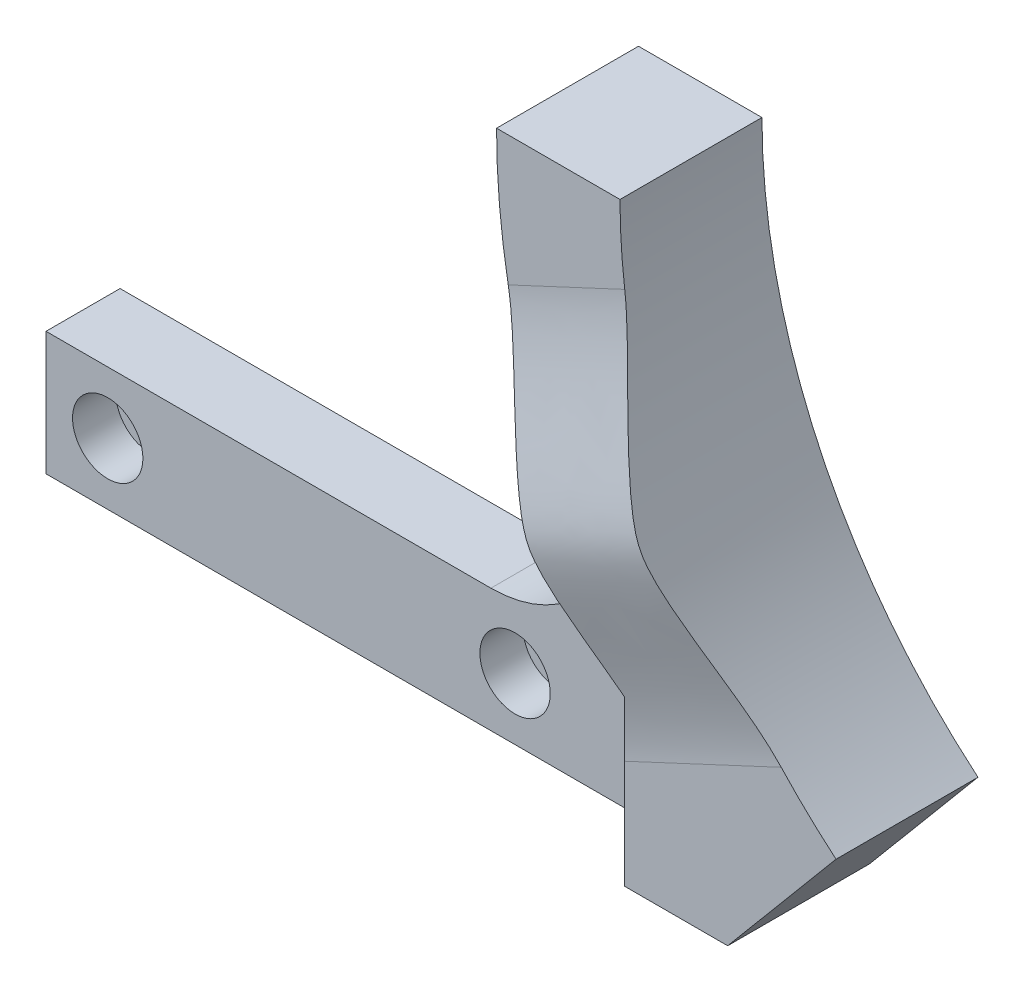
ISO-10303-21;
HEADER;
FILE_DESCRIPTION(('STEP AP214'),'2;1');
FILE_NAME('part.step','',(''),(''),'','','');
FILE_SCHEMA(('AUTOMOTIVE_DESIGN { 1 0 10303 214 1 1 1 1 }'));
ENDSEC;
DATA;
#1=APPLICATION_CONTEXT('core data for automotive mechanical design processes');
#2=APPLICATION_PROTOCOL_DEFINITION('international standard','automotive_design',2000,#1);
#3=PRODUCT_CONTEXT('',#1,'mechanical');
#4=PRODUCT('Part','Part','',(#3));
#5=PRODUCT_RELATED_PRODUCT_CATEGORY('part','',(#4));
#6=PRODUCT_DEFINITION_FORMATION('','',#4);
#7=PRODUCT_DEFINITION_CONTEXT('part definition',#1,'design');
#8=PRODUCT_DEFINITION('design','',#6,#7);
#9=PRODUCT_DEFINITION_SHAPE('','',#8);
#10=(LENGTH_UNIT() NAMED_UNIT(*) SI_UNIT(.MILLI.,.METRE.));
#11=(NAMED_UNIT(*) PLANE_ANGLE_UNIT() SI_UNIT($,.RADIAN.));
#12=(NAMED_UNIT(*) SI_UNIT($,.STERADIAN.) SOLID_ANGLE_UNIT());
#13=UNCERTAINTY_MEASURE_WITH_UNIT(LENGTH_MEASURE(1.E-05),#10,'distance_accuracy_value','');
#14=(GEOMETRIC_REPRESENTATION_CONTEXT(3) GLOBAL_UNCERTAINTY_ASSIGNED_CONTEXT((#13)) GLOBAL_UNIT_ASSIGNED_CONTEXT((#10,
#11,#12)) REPRESENTATION_CONTEXT('',''));
#15=CARTESIAN_POINT('',(0.,0.,0.));
#16=DIRECTION('',(0.,0.,1.));
#17=DIRECTION('',(1.,0.,0.));
#18=AXIS2_PLACEMENT_3D('',#15,#16,#17);
#19=CARTESIAN_POINT('',(0.,-48.,16.));
#20=DIRECTION('',(0.,-1.,0.));
#21=DIRECTION('',(0.,0.,-1.));
#22=AXIS2_PLACEMENT_3D('',#19,#20,#21);
#23=PLANE('',#22);
#24=DIRECTION('',(0.,0.,-1.));
#25=VECTOR('',#24,1.);
#26=CARTESIAN_POINT('',(-40.2767822965092,-48.,16.));
#27=LINE('',#26,#25);
#28=CARTESIAN_POINT('',(-40.2767822965092,-48.,11.5));
#29=VERTEX_POINT('',#28);
#30=CARTESIAN_POINT('',(-40.2767822965092,-48.,0.));
#31=VERTEX_POINT('',#30);
#32=EDGE_CURVE('E195',#29,#31,#27,.T.);
#33=ORIENTED_EDGE('',*,*,#32,.F.);
#34=DIRECTION('',(-1.,0.,0.));
#35=VECTOR('',#34,1.);
#36=CARTESIAN_POINT('',(0.,-48.,11.5));
#37=LINE('',#36,#35);
#38=CARTESIAN_POINT('',(-48.633136385587,-48.,11.5));
#39=VERTEX_POINT('',#38);
#40=EDGE_CURVE('E240',#29,#39,#37,.T.);
#41=ORIENTED_EDGE('',*,*,#40,.T.);
#42=DIRECTION('',(0.707106781186552,0.,0.707106781186543));
#43=VECTOR('',#42,1.);
#44=CARTESIAN_POINT('',(-54.1331363855871,-48.,6.));
#45=LINE('',#44,#43);
#46=CARTESIAN_POINT('',(-54.1331363855871,-48.,6.));
#47=VERTEX_POINT('',#46);
#48=EDGE_CURVE('E159',#39,#47,#45,.F.);
#49=ORIENTED_EDGE('',*,*,#48,.T.);
#50=DIRECTION('',(1.,0.,0.));
#51=VECTOR('',#50,1.);
#52=CARTESIAN_POINT('',(0.,-48.,6.));
#53=LINE('',#52,#51);
#54=CARTESIAN_POINT('',(-101.,-48.,6.));
#55=VERTEX_POINT('',#54);
#56=EDGE_CURVE('E238',#55,#47,#53,.T.);
#57=ORIENTED_EDGE('',*,*,#56,.F.);
#58=DIRECTION('',(0.,0.,-1.));
#59=VECTOR('',#58,1.);
#60=CARTESIAN_POINT('',(-101.,-48.,6.));
#61=LINE('',#60,#59);
#62=CARTESIAN_POINT('',(-101.,-48.,0.));
#63=VERTEX_POINT('',#62);
#64=EDGE_CURVE('E247',#55,#63,#61,.T.);
#65=ORIENTED_EDGE('',*,*,#64,.T.);
#66=DIRECTION('',(-1.,0.,0.));
#67=VECTOR('',#66,1.);
#68=CARTESIAN_POINT('',(0.,-48.,0.));
#69=LINE('',#68,#67);
#70=EDGE_CURVE('E290',#31,#63,#69,.T.);
#71=ORIENTED_EDGE('',*,*,#70,.F.);
#72=EDGE_LOOP('',(#33,#41,#49,#57,#65,#71));
#73=FACE_BOUND('',#72,.T.);
#74=ADVANCED_FACE('F51',(#73),#23,.T.);
#75=CARTESIAN_POINT('',(0.,0.,16.));
#76=DIRECTION('',(0.76604444311898,-0.642787609686537,0.));
#77=DIRECTION('',(0.642787609686537,0.76604444311898,0.));
#78=AXIS2_PLACEMENT_3D('',#75,#76,#77);
#79=PLANE('',#78);
#80=DIRECTION('',(0.,0.,-1.));
#81=VECTOR('',#80,1.);
#82=CARTESIAN_POINT('',(-31.4965928746403,-37.53617771283,16.));
#83=LINE('',#82,#81);
#84=CARTESIAN_POINT('',(-31.4965928746414,-37.5361777128291,11.5));
#85=VERTEX_POINT('',#84);
#86=CARTESIAN_POINT('',(-31.4965928746403,-37.53617771283,0.));
#87=VERTEX_POINT('',#86);
#88=EDGE_CURVE('E207',#85,#87,#83,.T.);
#89=ORIENTED_EDGE('',*,*,#88,.F.);
#90=DIRECTION('',(-0.642787609686537,-0.76604444311898,0.));
#91=VECTOR('',#90,1.);
#92=CARTESIAN_POINT('',(0.,0.,11.5));
#93=LINE('',#92,#91);
#94=EDGE_CURVE('E609',#85,#29,#93,.T.);
#95=ORIENTED_EDGE('',*,*,#94,.T.);
#96=ORIENTED_EDGE('',*,*,#32,.T.);
#97=DIRECTION('',(-0.642787609686537,-0.76604444311898,0.));
#98=VECTOR('',#97,1.);
#99=CARTESIAN_POINT('',(0.,0.,0.));
#100=LINE('',#99,#98);
#101=EDGE_CURVE('E293',#87,#31,#100,.T.);
#102=ORIENTED_EDGE('',*,*,#101,.F.);
#103=EDGE_LOOP('',(#89,#95,#96,#102));
#104=FACE_BOUND('',#103,.T.);
#105=ADVANCED_FACE('F313',(#104),#79,.T.);
#106=CARTESIAN_POINT('',(0.,0.,16.));
#107=DIRECTION('',(0.,0.,-1.));
#108=DIRECTION('',(-1.,0.,0.));
#109=AXIS2_PLACEMENT_3D('',#106,#107,#108);
#110=CYLINDRICAL_SURFACE('',#109,49.);
#111=CARTESIAN_POINT('',(-35.9378229389647,-33.308750838295,11.5));
#112=CARTESIAN_POINT('',(-36.0828055718518,-33.1523282330396,11.5000441153684));
#113=CARTESIAN_POINT('',(-36.226724633925,-32.9949977314904,11.5049518741036));
#114=CARTESIAN_POINT('',(-36.511779429045,-32.6792744581744,11.5232151562087));
#115=CARTESIAN_POINT('',(-36.6529229322838,-32.520887082193,11.536542038536));
#116=CARTESIAN_POINT('',(-36.932497551675,-32.2030334747427,11.5703502989782));
#117=CARTESIAN_POINT('',(-37.0709331634734,-32.0435697515184,11.5908185244696));
#118=CARTESIAN_POINT('',(-37.3451679828523,-31.7235368961756,11.6379219546674));
#119=CARTESIAN_POINT('',(-37.4809693154321,-31.5629688097481,11.664551943769));
#120=CARTESIAN_POINT('',(-37.7499869502496,-31.2407191341297,11.7231461916373));
#121=CARTESIAN_POINT('',(-37.8832038511465,-31.0790378148553,11.7551091981861));
#122=CARTESIAN_POINT('',(-38.1470936488032,-30.7545603504607,11.8236675394904));
#123=CARTESIAN_POINT('',(-38.277766260099,-30.5917640829841,11.8602633906251));
#124=CARTESIAN_POINT('',(-38.5392287458043,-30.2617427733269,11.9382622141065));
#125=CARTESIAN_POINT('',(-38.6699656215607,-30.0944955661962,11.9797486595496));
#126=CARTESIAN_POINT('',(-38.9288641930752,-29.7588386049857,12.0663414845673));
#127=CARTESIAN_POINT('',(-39.0570248108574,-29.590428402309,12.1114493415754));
#128=CARTESIAN_POINT('',(-39.310783613101,-29.2524692390308,12.2047667580792));
#129=CARTESIAN_POINT('',(-39.4363811011953,-29.0829199851667,12.2529771460943));
#130=CARTESIAN_POINT('',(-39.6850200442705,-28.742713437895,12.3520192910415));
#131=CARTESIAN_POINT('',(-39.8080614469559,-28.572056121911,12.4028511015317));
#132=CARTESIAN_POINT('',(-40.051590741875,-28.2296687839662,12.5066810377909));
#133=CARTESIAN_POINT('',(-40.1720794125876,-28.0579391103332,12.5596784882571));
#134=CARTESIAN_POINT('',(-40.4105035410321,-27.7134453493053,12.6673986159432));
#135=CARTESIAN_POINT('',(-40.5284407381459,-27.5406820761259,12.7221200511017));
#136=CARTESIAN_POINT('',(-40.775126317168,-27.1743117146055,12.8391934911535));
#137=CARTESIAN_POINT('',(-40.9035850893837,-26.9805614209489,12.9017074156669));
#138=CARTESIAN_POINT('',(-41.1575330220406,-26.591566540405,13.027819482014));
#139=CARTESIAN_POINT('',(-41.2830230803936,-26.3963224296048,13.0914172857425));
#140=CARTESIAN_POINT('',(-41.5312388683576,-26.0040403355113,13.219159821038));
#141=CARTESIAN_POINT('',(-41.6539624360739,-25.8070011074669,13.2833049297859));
#142=CARTESIAN_POINT('',(-41.8968404437741,-25.4108018355647,13.4115381568075));
#143=CARTESIAN_POINT('',(-42.016989862519,-25.2116386130278,13.4756259647461));
#144=CARTESIAN_POINT('',(-42.254911511439,-24.8108227345368,13.603023325155));
#145=CARTESIAN_POINT('',(-42.3726759905225,-24.6091646013167,13.6663301389729));
#146=CARTESIAN_POINT('',(-42.6021038522851,-24.2097542611364,13.7891426101433));
#147=CARTESIAN_POINT('',(-42.7138445438159,-24.0120640625562,13.8487053201927));
#148=CARTESIAN_POINT('',(-42.9349478190919,-23.6144450135583,13.9648400444535));
#149=CARTESIAN_POINT('',(-43.0443101380782,-23.414515917623,14.0214117266988));
#150=CARTESIAN_POINT('',(-43.2064929010695,-23.1130253839932,14.1027081525129));
#151=CARTESIAN_POINT('',(-43.2601735035993,-23.0123973497659,14.1291805758259));
#152=CARTESIAN_POINT('',(-43.366980123375,-22.8104818099786,14.1806876626119));
#153=CARTESIAN_POINT('',(-43.4201061509933,-22.7091943168101,14.2057223530143));
#154=CARTESIAN_POINT('',(-43.5255565338999,-22.5064195860316,14.253896568427));
#155=CARTESIAN_POINT('',(-43.5778835597155,-22.4049358363346,14.2770448848703));
#156=CARTESIAN_POINT('',(-43.6820205398699,-22.2012199779834,14.3211547080317));
#157=CARTESIAN_POINT('',(-43.7338304674844,-22.0989878311195,14.3421161022501));
#158=CARTESIAN_POINT('',(-43.8366427739065,-21.8943323064776,14.3811757920565));
#159=CARTESIAN_POINT('',(-43.8876480924343,-21.7919134690969,14.3992899735689));
#160=CARTESIAN_POINT('',(-43.9891633566667,-21.5862608762958,14.4320408578336));
#161=CARTESIAN_POINT('',(-44.0396732814748,-21.4830270868284,14.446677414495));
#162=CARTESIAN_POINT('',(-44.1448167584286,-21.2661931112256,14.4722946595423));
#163=CARTESIAN_POINT('',(-44.1994022391035,-21.1525128692056,14.4828152112044));
#164=CARTESIAN_POINT('',(-44.3078871815031,-20.9243182782984,14.4968027204552));
#165=CARTESIAN_POINT('',(-44.3617863577678,-20.8098036115977,14.5002668324885));
#166=CARTESIAN_POINT('',(-44.4686965692171,-20.5803558826527,14.4997003943759));
#167=CARTESIAN_POINT('',(-44.5217074386724,-20.4654227470991,14.4956684610782));
#168=CARTESIAN_POINT('',(-44.6266571623179,-20.2355488502493,14.4807176147875));
#169=CARTESIAN_POINT('',(-44.6785961307452,-20.1206080910892,14.4697994396462));
#170=CARTESIAN_POINT('',(-44.7816036678982,-19.8902985783187,14.4421619173692));
#171=CARTESIAN_POINT('',(-44.8326659810908,-19.7749308884846,14.4254114003187));
#172=CARTESIAN_POINT('',(-44.933645698972,-19.5443937160841,14.3875731056845));
#173=CARTESIAN_POINT('',(-44.9835628571685,-19.4292242810357,14.366484403874));
#174=CARTESIAN_POINT('',(-45.0823089059267,-19.1989874761285,14.3211408272418));
#175=CARTESIAN_POINT('',(-45.1311372965341,-19.0839201755436,14.2968845315641));
#176=CARTESIAN_POINT('',(-45.2277280521555,-18.8538637989774,14.2459635195538));
#177=CARTESIAN_POINT('',(-45.2754903258398,-18.7388747305096,14.2192985978643));
#178=CARTESIAN_POINT('',(-45.38746513735,-18.4663752155322,14.1539147618353));
#179=CARTESIAN_POINT('',(-45.4512255794578,-18.3088739486529,14.1143863135115));
#180=CARTESIAN_POINT('',(-45.5768598200282,-17.9938486560278,14.0328986732228));
#181=CARTESIAN_POINT('',(-45.6387345280201,-17.8363246792872,13.9909406823312));
#182=CARTESIAN_POINT('',(-45.76068731222,-17.521074649146,13.9052925380865));
#183=CARTESIAN_POINT('',(-45.8207655778234,-17.3633486188889,13.8616025684701));
#184=CARTESIAN_POINT('',(-45.9390569893807,-17.0479135283135,13.7731174231425));
#185=CARTESIAN_POINT('',(-45.9972737929884,-16.8902051302728,13.7283247657109));
#186=CARTESIAN_POINT('',(-46.1120184393976,-16.5743774078248,13.6379601999414));
#187=CARTESIAN_POINT('',(-46.1685460972137,-16.4162580404567,13.5923882071084));
#188=CARTESIAN_POINT('',(-46.2799359218681,-16.0995561484501,13.5008119416404));
#189=CARTESIAN_POINT('',(-46.3347980659433,-15.9409736175139,13.4548076631084));
#190=CARTESIAN_POINT('',(-46.4336231957289,-15.6504942585105,13.3705483273839));
#191=CARTESIAN_POINT('',(-46.4778436463898,-15.5186785268271,13.3323154626469));
#192=CARTESIAN_POINT('',(-46.5651635896562,-15.2546671553238,13.255898782844));
#193=CARTESIAN_POINT('',(-46.6082631155408,-15.1224715269124,13.2177149663541));
#194=CARTESIAN_POINT('',(-46.7359576124775,-14.7250721349627,13.1033813188175));
#195=CARTESIAN_POINT('',(-46.8188824380089,-14.4592500400537,13.0275060437007));
#196=CARTESIAN_POINT('',(-46.9803370311459,-13.92571828793,12.8774449519479));
#197=CARTESIAN_POINT('',(-47.0588656421176,-13.6580081546431,12.8032595829388));
#198=CARTESIAN_POINT('',(-47.2115058885154,-13.1206596889626,12.6575184334174));
#199=CARTESIAN_POINT('',(-47.2856181407824,-12.8510216317656,12.5859622862146));
#200=CARTESIAN_POINT('',(-47.4293970675374,-12.3097791127305,12.4464126880359));
#201=CARTESIAN_POINT('',(-47.4990657100952,-12.0381755815867,12.3784176622637));
#202=CARTESIAN_POINT('',(-47.6339259418596,-11.4929506001563,12.2469614948551));
#203=CARTESIAN_POINT('',(-47.6991202787174,-11.2193305046647,12.1834975697072));
#204=CARTESIAN_POINT('',(-47.8220139751161,-10.6830231164106,12.0650433178204));
#205=CARTESIAN_POINT('',(-47.8799229023432,-10.420441675006,12.0097924474002));
#206=CARTESIAN_POINT('',(-47.991625116054,-9.89325519587722,11.9054085549287));
#207=CARTESIAN_POINT('',(-48.045419410014,-9.62865067107559,11.8562740334162));
#208=CARTESIAN_POINT('',(-48.1488521105505,-9.0973239799196,11.7653687460721));
#209=CARTESIAN_POINT('',(-48.1984899424817,-8.83060152631671,11.7235989975664));
#210=CARTESIAN_POINT('',(-48.2935705299352,-8.29488433018129,11.6489431086666));
#211=CARTESIAN_POINT('',(-48.3390094001564,-8.02588772962679,11.6160651427162));
#212=CARTESIAN_POINT('',(-48.403960199066,-7.62072248164495,11.5749007150416));
#213=CARTESIAN_POINT('',(-48.4250995655423,-7.48522364803535,11.5625279542851));
#214=CARTESIAN_POINT('',(-48.4662735186563,-7.21381788053962,11.5408301318664));
#215=CARTESIAN_POINT('',(-48.4863081583991,-7.07791096660204,11.5315049235992));
#216=CARTESIAN_POINT('',(-48.5253533745721,-6.80508319944103,11.516201317669));
#217=CARTESIAN_POINT('',(-48.5443585152489,-6.6681606249287,11.5102393651308));
#218=CARTESIAN_POINT('',(-48.5812264995326,-6.39402661694983,11.5021439632996));
#219=CARTESIAN_POINT('',(-48.5990891455586,-6.2568151377359,11.5000111744983));
#220=CARTESIAN_POINT('',(-48.6163707911857,-6.11951722719552,11.5));
#221=B_SPLINE_CURVE_WITH_KNOTS('',3,(#111,#112,#113,#114,#115,#116,#117,#118,#119,#120,#121,
#122,#123,#124,#125,#126,#127,#128,#129,#130,#131,#132,#133,#134,#135,#136,#137,#138,#139,#140,
#141,#142,#143,#144,#145,#146,#147,#148,#149,#150,#151,#152,#153,#154,#155,#156,#157,#158,#159,
#160,#161,#162,#163,#164,#165,#166,#167,#168,#169,#170,#171,#172,#173,#174,#175,#176,#177,#178,
#179,#180,#181,#182,#183,#184,#185,#186,#187,#188,#189,#190,#191,#192,#193,#194,#195,#196,#197,
#198,#199,#200,#201,#202,#203,#204,#205,#206,#207,#208,#209,#210,#211,#212,#213,#214,#215,#216,
#217,#218,#219,#220),.UNSPECIFIED.,.F.,.F.,(4,2,2,2,2,2,2,2,2,2,2,2,2,2,2,2,2,2,2,2,2,2,2,2,2,2,
2,2,2,2,2,2,2,2,2,2,2,2,2,2,2,2,2,2,2,2,2,2,2,2,2,2,2,2,4),(0.,0.639696180130485,
1.27722780894541,1.91359140375036,2.54941830847455,3.18509612758451,3.82084486216108,
4.46968543790952,5.11879208068067,5.76807279009824,6.41736677019793,7.06645980593937,
7.71509543462776,8.43724471151841,9.15917270124803,9.88164655167936,10.6054206593946,
11.3312575683189,12.0355250984702,12.7398706300016,13.0911098709515,13.4423425308765,
13.7918315184542,14.1413384755959,14.4888202808314,14.836316680791,15.215777989146,
15.5953922874817,15.9750766382546,16.3547203132595,16.7364248836928,17.1182108585948,
17.5001686794885,17.8821590964889,18.4054867397553,18.9285578426642,19.4515736033739,
19.9734891343529,20.4954616145353,21.0174412254627,21.4500253578616,21.8825966325987,
22.7483775452001,23.6143851824745,24.480271578004,25.3457717715209,26.2107356193148,
27.0341696313839,27.8574013742057,28.6807467444019,29.5048464837918,29.9178995317241,
30.3309327064752,30.7459683400551,31.1610755561678),.UNSPECIFIED.);
#222=CARTESIAN_POINT('',(-35.9378229389647,-33.3087508382951,11.5));
#223=VERTEX_POINT('',#222);
#224=CARTESIAN_POINT('',(-48.6163707911857,-6.11951722719556,11.5));
#225=VERTEX_POINT('',#224);
#226=EDGE_CURVE('E320',#223,#225,#221,.T.);
#227=ORIENTED_EDGE('',*,*,#226,.F.);
#228=CARTESIAN_POINT('',(0.,0.,11.5));
#229=DIRECTION('',(0.,0.,1.));
#230=DIRECTION('',(0.,-1.,0.));
#231=AXIS2_PLACEMENT_3D('',#228,#229,#230);
#232=CIRCLE('',#231,49.);
#233=EDGE_CURVE('E165',#223,#85,#232,.T.);
#234=ORIENTED_EDGE('',*,*,#233,.T.);
#235=ORIENTED_EDGE('',*,*,#88,.T.);
#236=CARTESIAN_POINT('',(0.,0.,0.));
#237=DIRECTION('',(0.,0.,1.));
#238=DIRECTION('',(1.,0.,0.));
#239=AXIS2_PLACEMENT_3D('',#236,#237,#238);
#240=CIRCLE('',#239,49.);
#241=CARTESIAN_POINT('',(-49.,0.,0.));
#242=VERTEX_POINT('',#241);
#243=EDGE_CURVE('E297',#242,#87,#240,.T.);
#244=ORIENTED_EDGE('',*,*,#243,.F.);
#245=DIRECTION('',(0.,0.,-1.));
#246=VECTOR('',#245,1.);
#247=CARTESIAN_POINT('',(-49.,0.,16.));
#248=LINE('',#247,#246);
#249=CARTESIAN_POINT('',(-49.,0.,11.5));
#250=VERTEX_POINT('',#249);
#251=EDGE_CURVE('E301',#250,#242,#248,.T.);
#252=ORIENTED_EDGE('',*,*,#251,.F.);
#253=CARTESIAN_POINT('',(0.,0.,11.5));
#254=DIRECTION('',(0.,0.,-1.));
#255=DIRECTION('',(0.,1.,0.));
#256=AXIS2_PLACEMENT_3D('',#253,#254,#255);
#257=CIRCLE('',#256,49.);
#258=EDGE_CURVE('E173',#225,#250,#257,.T.);
#259=ORIENTED_EDGE('',*,*,#258,.F.);
#260=EDGE_LOOP('',(#227,#234,#235,#244,#252,#259));
#261=FACE_BOUND('',#260,.T.);
#262=ADVANCED_FACE('F309',(#261),#110,.F.);
#263=CARTESIAN_POINT('',(-54.1331363855871,0.,6.));
#264=DIRECTION('',(-0.707106781186543,0.,0.707106781186552));
#265=DIRECTION('',(0.,-1.,0.));
#266=AXIS2_PLACEMENT_3D('',#263,#264,#265);
#267=PLANE('',#266);
#268=DIRECTION('',(0.,1.,0.));
#269=VECTOR('',#268,1.);
#270=CARTESIAN_POINT('',(-48.6331363855871,0.,11.5));
#271=LINE('',#270,#269);
#272=CARTESIAN_POINT('',(-48.633136385587,-39.228672721133,11.5));
#273=VERTEX_POINT('',#272);
#274=EDGE_CURVE('E158',#273,#39,#271,.F.);
#275=ORIENTED_EDGE('',*,*,#274,.F.);
#276=CARTESIAN_POINT('',(-48.633136385587,-39.228672721133,11.5));
#277=CARTESIAN_POINT('',(-48.6331258540808,-39.1022612927181,11.5000105315062));
#278=CARTESIAN_POINT('',(-48.6315595329767,-38.9758669130698,11.5015768526103));
#279=CARTESIAN_POINT('',(-48.6256531915161,-38.7232350293088,11.507483194071));
#280=CARTESIAN_POINT('',(-48.6213138211392,-38.5969974953783,11.5118225644478));
#281=CARTESIAN_POINT('',(-48.6102262823021,-38.3453632950724,11.522910103285));
#282=CARTESIAN_POINT('',(-48.6034900700235,-38.2199655473611,11.5296463155636));
#283=CARTESIAN_POINT('',(-48.5878720535509,-37.9694327559949,11.5452643320361));
#284=CARTESIAN_POINT('',(-48.5789901078312,-37.8442977302177,11.5541462777559));
#285=CARTESIAN_POINT('',(-48.5495281904233,-37.4699006744465,11.5836081951638));
#286=CARTESIAN_POINT('',(-48.526105064828,-37.2210824517704,11.607031320759));
#287=CARTESIAN_POINT('',(-48.4731776620089,-36.7249521162199,11.6599587235781));
#288=CARTESIAN_POINT('',(-48.4436776105079,-36.4776390790613,11.6894587750792));
#289=CARTESIAN_POINT('',(-48.3796991680428,-35.9843092222954,11.7534372175442));
#290=CARTESIAN_POINT('',(-48.3452206797331,-35.7382924281315,11.7879157058539));
#291=CARTESIAN_POINT('',(-48.2722587981285,-35.2481623843473,11.8608775874585));
#292=CARTESIAN_POINT('',(-48.2337866258064,-35.0040457675113,11.8993497597806));
#293=CARTESIAN_POINT('',(-48.1534209546344,-34.516760064044,11.9797154309526));
#294=CARTESIAN_POINT('',(-48.1115249895043,-34.2735917950227,12.0216113960828));
#295=CARTESIAN_POINT('',(-48.0248763238047,-33.7881205044935,12.1082600617823));
#296=CARTESIAN_POINT('',(-47.9801218820686,-33.5458181071353,12.1530145035184));
#297=CARTESIAN_POINT('',(-47.8882398475198,-33.0620265929839,12.2448965380673));
#298=CARTESIAN_POINT('',(-47.8411114264962,-32.8205377918183,12.2920249590908));
#299=CARTESIAN_POINT('',(-47.7449072862661,-32.3383435659579,12.3882290993209));
#300=CARTESIAN_POINT('',(-47.6958315975466,-32.0976381290622,12.4373047880405));
#301=CARTESIAN_POINT('',(-47.5868485121133,-31.5723096228772,12.5462878734737));
#302=CARTESIAN_POINT('',(-47.5266201244363,-31.287820007937,12.6065162611507));
#303=CARTESIAN_POINT('',(-47.404510061267,-30.7196731591138,12.72862632432));
#304=CARTESIAN_POINT('',(-47.3426290290903,-30.4360156477007,12.7905073564967));
#305=CARTESIAN_POINT('',(-47.2177214342987,-29.8692858769972,12.9154149512883));
#306=CARTESIAN_POINT('',(-47.1546951662706,-29.586213487492,12.9784412193164));
#307=CARTESIAN_POINT('',(-47.0280018052122,-29.0204089556606,13.1051345803748));
#308=CARTESIAN_POINT('',(-46.9643348217915,-28.7376767640987,13.1688015637955));
#309=CARTESIAN_POINT('',(-46.836891313273,-28.1722958082986,13.296245072314));
#310=CARTESIAN_POINT('',(-46.7731148008185,-27.8896470383353,13.3600215847685));
#311=CARTESIAN_POINT('',(-46.6458517850984,-27.3232798685408,13.4872846004886));
#312=CARTESIAN_POINT('',(-46.5823667352657,-27.0395608124695,13.5507696503213));
#313=CARTESIAN_POINT('',(-46.4566042973438,-26.4715739489722,13.6765320882433));
#314=CARTESIAN_POINT('',(-46.3943269569717,-26.1873061203498,13.7388094286154));
#315=CARTESIAN_POINT('',(-46.2719001976092,-25.6177963527031,13.8612361879778));
#316=CARTESIAN_POINT('',(-46.2117511252765,-25.33255426321,13.9213852603105));
#317=CARTESIAN_POINT('',(-46.1241148830345,-24.9035560732202,14.0090215025525));
#318=CARTESIAN_POINT('',(-46.0953272962711,-24.7603322818923,14.0378090893159));
#319=CARTESIAN_POINT('',(-46.0388550913202,-24.4734542943899,14.0942812942668));
#320=CARTESIAN_POINT('',(-46.0111704385906,-24.3298001118462,14.1219659469964));
#321=CARTESIAN_POINT('',(-45.9571469095821,-24.0417936704042,14.1759894760049));
#322=CARTESIAN_POINT('',(-45.9308097301422,-23.8974407702916,14.2023266554448));
#323=CARTESIAN_POINT('',(-45.8799214769649,-23.6080916026447,14.2532149086221));
#324=CARTESIAN_POINT('',(-45.8553705996853,-23.4630952662,14.2777657859017));
#325=CARTESIAN_POINT('',(-45.8319177017664,-23.3177325522374,14.3012186838205));
#326=B_SPLINE_CURVE_WITH_KNOTS('',3,(#276,#277,#278,#279,#280,#281,#282,#283,#284,#285,#286,
#287,#288,#289,#290,#291,#292,#293,#294,#295,#296,#297,#298,#299,#300,#301,#302,#303,#304,#305,
#306,#307,#308,#309,#310,#311,#312,#313,#314,#315,#316,#317,#318,#319,#320,#321,#322,#323,#324,
#325),.UNSPECIFIED.,.F.,.F.,(4,2,2,2,2,2,2,2,2,2,2,2,2,2,2,2,2,2,2,2,2,2,2,2,4),(0.,
0.379190680271229,0.758292513976875,1.13552918914733,1.51279075245233,2.26561890430465,
3.01792531721352,3.77024644232308,4.52050823782985,5.27131531974447,6.02258418028459,
6.77411697635047,7.52563801086035,8.4165238080879,9.3070677294965,10.1973857328483,
11.0875539312317,11.9776254854224,12.870379698003,13.7631691121859,14.6561032829396,
15.1027892340775,15.5494611847676,15.9966824313855,16.4439527893475),.UNSPECIFIED.);
#327=CARTESIAN_POINT('',(-48.0938738821042,-34.1757120629879,12.0392625034829));
#328=VERTEX_POINT('',#327);
#329=EDGE_CURVE('E146',#273,#328,#326,.T.);
#330=ORIENTED_EDGE('',*,*,#329,.T.);
#331=CARTESIAN_POINT('',(0.,0.,60.1331363855865));
#332=DIRECTION('',(-0.707106781186543,0.,0.707106781186552));
#333=DIRECTION('',(-0.707106781186552,0.,-0.707106781186543));
#334=AXIS2_PLACEMENT_3D('',#331,#332,#333);
#335=ELLIPSE('',#334,83.4386001800121,59.);
#336=CARTESIAN_POINT('',(-54.1331363855871,-23.4649428948682,6.));
#337=VERTEX_POINT('',#336);
#338=EDGE_CURVE('E231',#337,#328,#335,.T.);
#339=ORIENTED_EDGE('',*,*,#338,.F.);
#340=DIRECTION('',(0.,1.,0.));
#341=VECTOR('',#340,1.);
#342=CARTESIAN_POINT('',(-54.1331363855871,-38.,6.));
#343=LINE('',#342,#341);
#344=EDGE_CURVE('E227',#47,#337,#343,.T.);
#345=ORIENTED_EDGE('',*,*,#344,.F.);
#346=ORIENTED_EDGE('',*,*,#48,.F.);
#347=EDGE_LOOP('',(#275,#330,#339,#345,#346));
#348=FACE_BOUND('',#347,.T.);
#349=ADVANCED_FACE('F170',(#348),#267,.T.);
#350=CARTESIAN_POINT('',(0.,0.,16.));
#351=DIRECTION('',(0.,-1.,0.));
#352=DIRECTION('',(0.,0.,-1.));
#353=AXIS2_PLACEMENT_3D('',#350,#351,#352);
#354=PLANE('',#353);
#355=DIRECTION('',(0.,0.,-1.));
#356=VECTOR('',#355,1.);
#357=CARTESIAN_POINT('',(-59.,0.,16.));
#358=LINE('',#357,#356);
#359=CARTESIAN_POINT('',(-59.,0.,11.5));
#360=VERTEX_POINT('',#359);
#361=CARTESIAN_POINT('',(-59.,0.,0.));
#362=VERTEX_POINT('',#361);
#363=EDGE_CURVE('E193',#360,#362,#358,.T.);
#364=ORIENTED_EDGE('',*,*,#363,.F.);
#365=DIRECTION('',(1.,0.,0.));
#366=VECTOR('',#365,1.);
#367=CARTESIAN_POINT('',(0.,0.,11.5));
#368=LINE('',#367,#366);
#369=EDGE_CURVE('E318',#360,#250,#368,.T.);
#370=ORIENTED_EDGE('',*,*,#369,.T.);
#371=ORIENTED_EDGE('',*,*,#251,.T.);
#372=DIRECTION('',(-1.,0.,0.));
#373=VECTOR('',#372,1.);
#374=CARTESIAN_POINT('',(0.,0.,0.));
#375=LINE('',#374,#373);
#376=EDGE_CURVE('E283',#242,#362,#375,.T.);
#377=ORIENTED_EDGE('',*,*,#376,.T.);
#378=EDGE_LOOP('',(#364,#370,#371,#377));
#379=FACE_BOUND('',#378,.T.);
#380=ADVANCED_FACE('F316',(#379),#354,.F.);
#381=CARTESIAN_POINT('',(0.,0.,16.));
#382=DIRECTION('',(0.,0.,-1.));
#383=DIRECTION('',(-1.,0.,0.));
#384=AXIS2_PLACEMENT_3D('',#381,#382,#383);
#385=CYLINDRICAL_SURFACE('',#384,59.);
#386=CARTESIAN_POINT('',(-45.375890470512,-37.7097940064395,11.5));
#387=CARTESIAN_POINT('',(-45.446253965841,-37.6251263924657,11.500003165524));
#388=CARTESIAN_POINT('',(-45.5163752732543,-37.5402676682313,11.5013616810718));
#389=CARTESIAN_POINT('',(-45.6560982826217,-37.3702126780047,11.5065809270849));
#390=CARTESIAN_POINT('',(-45.7257000335375,-37.2850164450069,11.5104414186809));
#391=CARTESIAN_POINT('',(-45.9331368070137,-37.0296491379864,11.5254234231554));
#392=CARTESIAN_POINT('',(-46.0701684156819,-36.859019452136,11.5399489083629));
#393=CARTESIAN_POINT('',(-46.3416125249617,-36.5171534077401,11.5766814481426));
#394=CARTESIAN_POINT('',(-46.4760301214839,-36.3459192077742,11.5988715440765));
#395=CARTESIAN_POINT('',(-46.7423504632007,-36.0027747764466,11.6497885440048));
#396=CARTESIAN_POINT('',(-46.8742557250706,-35.8308654549924,11.6785084882492));
#397=CARTESIAN_POINT('',(-47.1356260428236,-35.4863283343777,11.741548241151));
#398=CARTESIAN_POINT('',(-47.2650919443004,-35.3137008104893,11.7758660679509));
#399=CARTESIAN_POINT('',(-47.5216455396354,-34.9676935777252,11.849317329101));
#400=CARTESIAN_POINT('',(-47.648733079263,-34.7943138209611,11.8884510745129));
#401=CARTESIAN_POINT('',(-47.9025265106982,-34.4440917225211,11.9714978791894));
#402=CARTESIAN_POINT('',(-48.0291949142785,-34.2672378321092,12.0154764658856));
#403=CARTESIAN_POINT('',(-48.2801932858342,-33.912684025668,12.1070933716755));
#404=CARTESIAN_POINT('',(-48.4045220389103,-33.7349837270418,12.1547335301893));
#405=CARTESIAN_POINT('',(-48.6508714689516,-33.378730155017,12.2531179677648));
#406=CARTESIAN_POINT('',(-48.7728911449345,-33.2001765519015,12.3038635544176));
#407=CARTESIAN_POINT('',(-49.0146451148511,-32.8422170467852,12.407945659889));
#408=CARTESIAN_POINT('',(-49.1343788659158,-32.6628109546614,12.4612827837504));
#409=CARTESIAN_POINT('',(-49.3715786771103,-32.3031518915213,12.5700620020297));
#410=CARTESIAN_POINT('',(-49.4890448204982,-32.1228989519015,12.6255040189412));
#411=CARTESIAN_POINT('',(-49.7217242216087,-31.7615538208964,12.7380207410463));
#412=CARTESIAN_POINT('',(-49.8369383007697,-31.5804619664864,12.795094831501));
#413=CARTESIAN_POINT('',(-50.0640962829114,-31.2190865471301,12.9098829634234));
#414=CARTESIAN_POINT('',(-50.1760611586927,-31.0388124266023,12.9675852689224));
#415=CARTESIAN_POINT('',(-50.3979029466342,-30.6772936085655,13.0837086374096));
#416=CARTESIAN_POINT('',(-50.5077804666378,-30.4960492139375,13.1421294827329));
#417=CARTESIAN_POINT('',(-50.725562747215,-30.1324112790402,13.2592459415164));
#418=CARTESIAN_POINT('',(-50.8334670842141,-29.9500175030795,13.3179416106526));
#419=CARTESIAN_POINT('',(-51.0474167197661,-29.5838847320641,13.4351121663681));
#420=CARTESIAN_POINT('',(-51.1534606411264,-29.400144872294,13.4935868661677));
#421=CARTESIAN_POINT('',(-51.363805703961,-29.0310976371745,13.6097352654666));
#422=CARTESIAN_POINT('',(-51.4681045578751,-28.8457886209597,13.6674078990462));
#423=CARTESIAN_POINT('',(-51.6723171655837,-28.4783200501797,13.7797144093027));
#424=CARTESIAN_POINT('',(-51.7722753768028,-28.2961974538506,13.834388206352));
#425=CARTESIAN_POINT('',(-51.9705628695924,-27.9303399869584,13.94132396939));
#426=CARTESIAN_POINT('',(-52.0688920289607,-27.7466049970104,13.993585754964));
#427=CARTESIAN_POINT('',(-52.2639020499497,-27.3775102315005,14.0944590971005));
#428=CARTESIAN_POINT('',(-52.3605844600634,-27.1921522624344,14.1430742480261));
#429=CARTESIAN_POINT('',(-52.5523371010432,-26.8196880102424,14.2349774167993));
#430=CARTESIAN_POINT('',(-52.6474098315186,-26.6325853062703,14.2782745046827));
#431=CARTESIAN_POINT('',(-52.78892953319,-26.3503314858304,14.3372997663879));
#432=CARTESIAN_POINT('',(-52.8358856487063,-26.2560530802761,14.3559760796992));
#433=CARTESIAN_POINT('',(-52.929471377059,-26.0668793032655,14.3908948473802));
#434=CARTESIAN_POINT('',(-52.9761009892759,-25.9719839306392,14.4071372971335));
#435=CARTESIAN_POINT('',(-53.0626784786307,-25.7945830714943,14.4345213807278));
#436=CARTESIAN_POINT('',(-53.1026674833841,-25.7121592045241,14.4460568730313));
#437=CARTESIAN_POINT('',(-53.1824022259629,-25.5468298303706,14.4661512270244));
#438=CARTESIAN_POINT('',(-53.2221479770211,-25.4639243498733,14.4747102520694));
#439=CARTESIAN_POINT('',(-53.3013207736592,-25.2977797717943,14.4882813728343));
#440=CARTESIAN_POINT('',(-53.3407481255427,-25.2145411500775,14.4932974182607));
#441=CARTESIAN_POINT('',(-53.4192679947449,-25.0477604088041,14.4994424728398));
#442=CARTESIAN_POINT('',(-53.4583605142317,-24.9642182912179,14.5005715071822));
#443=CARTESIAN_POINT('',(-53.5361333487736,-24.7969943447233,14.4988843742443));
#444=CARTESIAN_POINT('',(-53.5748137070527,-24.7133125315511,14.4960686248449));
#445=CARTESIAN_POINT('',(-53.6517038713417,-24.5459396756275,14.4867143328038));
#446=CARTESIAN_POINT('',(-53.6899136489117,-24.4622486326238,14.480175566275));
#447=CARTESIAN_POINT('',(-53.7658390077028,-24.2949172099863,14.4637870883197));
#448=CARTESIAN_POINT('',(-53.8035543090271,-24.2112768826136,14.4539355792389));
#449=CARTESIAN_POINT('',(-53.8784517391261,-24.0441432631645,14.4314024470009));
#450=CARTESIAN_POINT('',(-53.9156338590325,-23.960649973554,14.4187207768281));
#451=CARTESIAN_POINT('',(-53.9901762544671,-23.7922153520059,14.3908362360896));
#452=CARTESIAN_POINT('',(-54.0275263691623,-23.7072768205203,14.3755898383141));
#453=CARTESIAN_POINT('',(-54.1016953484321,-23.5375261820057,14.3432363466771));
#454=CARTESIAN_POINT('',(-54.1385142149963,-23.4527140745043,14.3261292597863));
#455=CARTESIAN_POINT('',(-54.2482862497531,-23.1982243115859,14.2725222395351));
#456=CARTESIAN_POINT('',(-54.3204682669457,-23.0286889108583,14.2337707789065));
#457=CARTESIAN_POINT('',(-54.4629867416156,-22.6895778591164,14.1521850358859));
#458=CARTESIAN_POINT('',(-54.533320728857,-22.5200024323465,14.1093456112712));
#459=CARTESIAN_POINT('',(-54.6722014886582,-22.180712519589,14.0208268616309));
#460=CARTESIAN_POINT('',(-54.7407469241625,-22.0109980221637,13.9751454937912));
#461=CARTESIAN_POINT('',(-54.8830566647982,-21.6538853818423,13.8770385204054));
#462=CARTESIAN_POINT('',(-54.9566299281827,-21.4664690171805,13.8244033079805));
#463=CARTESIAN_POINT('',(-55.1017150001197,-21.0912648468652,13.7176312581003));
#464=CARTESIAN_POINT('',(-55.1732267674731,-20.9034770338684,13.6634943906768));
#465=CARTESIAN_POINT('',(-55.3846674505626,-20.3396108964484,13.4999115118969));
#466=CARTESIAN_POINT('',(-55.5216053639931,-19.9627697797024,13.3892196709699));
#467=CARTESIAN_POINT('',(-55.7877030816727,-19.2065786134411,13.1684737116736));
#468=CARTESIAN_POINT('',(-55.9168697592206,-18.8272311204041,13.0584191099509));
#469=CARTESIAN_POINT('',(-56.1675906793719,-18.0655016110664,12.8419027243164));
#470=CARTESIAN_POINT('',(-56.2891532109116,-17.6831234295704,12.7354370887614));
#471=CARTESIAN_POINT('',(-56.5247619517083,-16.914861279107,12.5288026808229));
#472=CARTESIAN_POINT('',(-56.6388165411731,-16.5289817852906,12.4286268938161));
#473=CARTESIAN_POINT('',(-56.8524806284295,-15.7777688707875,12.2434142334266));
#474=CARTESIAN_POINT('',(-56.952547423543,-15.4127046641775,12.1578185025191));
#475=CARTESIAN_POINT('',(-57.1461855295717,-14.6784757463263,11.9972121120364));
#476=CARTESIAN_POINT('',(-57.2397560529666,-14.3093105442064,11.9222027346734));
#477=CARTESIAN_POINT('',(-57.4204099409394,-13.5662402917052,11.7860452649329));
#478=CARTESIAN_POINT('',(-57.5074844175004,-13.1923295376622,11.7249159381478));
#479=CARTESIAN_POINT('',(-57.6331391898949,-12.6276933973035,11.6470527087326));
#480=CARTESIAN_POINT('',(-57.6742718438333,-12.4384875395359,11.6233714642959));
#481=CARTESIAN_POINT('',(-57.754785653288,-12.0591181664725,11.5814503247316));
#482=CARTESIAN_POINT('',(-57.7941670170855,-11.8689547680681,11.5632097810601));
#483=CARTESIAN_POINT('',(-57.8714628536666,-11.4861746233592,11.532911452549));
#484=CARTESIAN_POINT('',(-57.9093624982339,-11.2935505948775,11.5209060577356));
#485=CARTESIAN_POINT('',(-57.9833087758336,-10.9075472385878,11.5044722069548));
#486=CARTESIAN_POINT('',(-58.0193546128361,-10.7141676240513,11.5000469800127));
#487=CARTESIAN_POINT('',(-58.054438322733,-10.5205603953399,11.5));
#488=B_SPLINE_CURVE_WITH_KNOTS('',3,(#386,#387,#388,#389,#390,#391,#392,#393,#394,#395,#396,
#397,#398,#399,#400,#401,#402,#403,#404,#405,#406,#407,#408,#409,#410,#411,#412,#413,#414,#415,
#416,#417,#418,#419,#420,#421,#422,#423,#424,#425,#426,#427,#428,#429,#430,#431,#432,#433,#434,
#435,#436,#437,#438,#439,#440,#441,#442,#443,#444,#445,#446,#447,#448,#449,#450,#451,#452,#453,
#454,#455,#456,#457,#458,#459,#460,#461,#462,#463,#464,#465,#466,#467,#468,#469,#470,#471,#472,
#473,#474,#475,#476,#477,#478,#479,#480,#481,#482,#483,#484,#485,#486,#487),.UNSPECIFIED.,.F.,
.F.,(4,2,2,2,2,2,2,2,2,2,2,2,2,2,2,2,2,2,2,2,2,2,2,2,2,2,2,2,2,2,2,2,2,2,2,2,2,2,2,2,2,2,2,2,2,
2,2,2,2,2,4),(0.,0.33024606646971,0.660460608238893,1.31823966487577,1.97457255174308,
2.63020914750054,3.28561412545147,3.94106145846269,4.60682485310833,5.27292491328378,
5.93930740171977,6.60584622427064,7.27236052726193,7.93862700377502,8.59837049137543,
9.25791882019852,9.91760710760956,10.5777647180206,11.2387288858174,11.8831822890477,
12.5276838185118,13.1715415015404,13.8142853612086,14.1351660730424,14.4560473934903,
14.7330165238961,15.0099704512022,15.2866151414411,15.5632580388827,15.8398716330589,
16.1165018633988,16.3932824495802,16.6700676340796,16.952139236535,17.2342097823098,
17.7990006349275,18.3645115420404,18.9304337482798,19.5547340031853,20.1790467261453,
21.4268039414483,22.6734408390569,23.9186942624231,25.1625333287311,26.3266117087821,
27.4908309604556,28.6566149669507,29.2417493510115,29.8268139578158,30.4167180492241,
31.006873367514),.UNSPECIFIED.);
#489=CARTESIAN_POINT('',(-58.0544383227329,-10.5205603953399,11.5));
#490=VERTEX_POINT('',#489);
#491=EDGE_CURVE('E153',#328,#490,#488,.T.);
#492=ORIENTED_EDGE('',*,*,#491,.T.);
#493=CARTESIAN_POINT('',(0.,0.,11.5));
#494=DIRECTION('',(0.,0.,-1.));
#495=DIRECTION('',(0.,1.,0.));
#496=AXIS2_PLACEMENT_3D('',#493,#494,#495);
#497=CIRCLE('',#496,59.);
#498=EDGE_CURVE('E324',#490,#360,#497,.T.);
#499=ORIENTED_EDGE('',*,*,#498,.T.);
#500=ORIENTED_EDGE('',*,*,#363,.T.);
#501=CARTESIAN_POINT('',(0.,0.,0.));
#502=DIRECTION('',(0.,0.,1.));
#503=DIRECTION('',(1.,0.,0.));
#504=AXIS2_PLACEMENT_3D('',#501,#502,#503);
#505=CIRCLE('',#504,59.);
#506=CARTESIAN_POINT('',(-54.4646187876371,-22.68491349592,0.));
#507=VERTEX_POINT('',#506);
#508=EDGE_CURVE('E287',#362,#507,#505,.T.);
#509=ORIENTED_EDGE('',*,*,#508,.T.);
#510=DIRECTION('',(0.,0.,-1.));
#511=VECTOR('',#510,1.);
#512=CARTESIAN_POINT('',(-54.4646187876371,-22.68491349592,16.));
#513=LINE('',#512,#511);
#514=CARTESIAN_POINT('',(-54.4646187876371,-22.68491349592,6.));
#515=VERTEX_POINT('',#514);
#516=EDGE_CURVE('E217',#507,#515,#513,.F.);
#517=ORIENTED_EDGE('',*,*,#516,.T.);
#518=CARTESIAN_POINT('',(0.,0.,6.));
#519=DIRECTION('',(0.,0.,1.));
#520=DIRECTION('',(1.,0.,0.));
#521=AXIS2_PLACEMENT_3D('',#518,#519,#520);
#522=CIRCLE('',#521,59.);
#523=EDGE_CURVE('E214',#515,#337,#522,.T.);
#524=ORIENTED_EDGE('',*,*,#523,.T.);
#525=ORIENTED_EDGE('',*,*,#338,.T.);
#526=EDGE_LOOP('',(#492,#499,#500,#509,#517,#524,#525));
#527=FACE_BOUND('',#526,.T.);
#528=ADVANCED_FACE('F249',(#527),#385,.T.);
#529=CARTESIAN_POINT('',(0.,0.,0.));
#530=DIRECTION('',(0.,0.,1.));
#531=DIRECTION('',(1.,0.,0.));
#532=AXIS2_PLACEMENT_3D('',#529,#530,#531);
#533=PLANE('',#532);
#534=ORIENTED_EDGE('',*,*,#376,.F.);
#535=ORIENTED_EDGE('',*,*,#243,.T.);
#536=ORIENTED_EDGE('',*,*,#101,.T.);
#537=ORIENTED_EDGE('',*,*,#70,.T.);
#538=DIRECTION('',(0.,1.,0.));
#539=VECTOR('',#538,1.);
#540=CARTESIAN_POINT('',(-101.,0.,0.));
#541=LINE('',#540,#539);
#542=CARTESIAN_POINT('',(-101.,-38.,0.));
#543=VERTEX_POINT('',#542);
#544=EDGE_CURVE('E265',#63,#543,#541,.T.);
#545=ORIENTED_EDGE('',*,*,#544,.T.);
#546=DIRECTION('',(1.,0.,0.));
#547=VECTOR('',#546,1.);
#548=CARTESIAN_POINT('',(0.,-38.,0.));
#549=LINE('',#548,#547);
#550=CARTESIAN_POINT('',(-64.9574171669624,-38.,0.));
#551=VERTEX_POINT('',#550);
#552=EDGE_CURVE('E258',#543,#551,#549,.T.);
#553=ORIENTED_EDGE('',*,*,#552,.T.);
#554=CARTESIAN_POINT('',(-64.9574171669624,-28.,0.));
#555=DIRECTION('',(0.,0.,1.));
#556=DIRECTION('',(1.,0.,0.));
#557=AXIS2_PLACEMENT_3D('',#554,#555,#556);
#558=CIRCLE('',#557,10.);
#559=CARTESIAN_POINT('',(-54.9940265772074,-28.8548964592165,0.));
#560=VERTEX_POINT('',#559);
#561=EDGE_CURVE('E60',#551,#560,#558,.T.);
#562=ORIENTED_EDGE('',*,*,#561,.T.);
#563=DIRECTION('',(0.0854896459216502,0.996339058975503,0.));
#564=VECTOR('',#563,1.);
#565=CARTESIAN_POINT('',(-52.1343397672323,4.47332281808023,0.));
#566=LINE('',#565,#564);
#567=EDGE_CURVE('E221',#560,#507,#566,.T.);
#568=ORIENTED_EDGE('',*,*,#567,.T.);
#569=ORIENTED_EDGE('',*,*,#508,.F.);
#570=EDGE_LOOP('',(#534,#535,#536,#537,#545,#553,#562,#568,#569));
#571=FACE_BOUND('',#570,.T.);
#572=CARTESIAN_POINT('',(-96.,-43.,0.));
#573=DIRECTION('',(0.,0.,1.));
#574=DIRECTION('',(1.,0.,0.));
#575=AXIS2_PLACEMENT_3D('',#572,#573,#574);
#576=CIRCLE('',#575,1.60000000000001);
#577=CARTESIAN_POINT('',(-94.4,-43.,0.));
#578=VERTEX_POINT('',#577);
#579=EDGE_CURVE('E267',#578,#578,#576,.T.);
#580=ORIENTED_EDGE('',*,*,#579,.T.);
#581=EDGE_LOOP('',(#580));
#582=FACE_BOUND('',#581,.T.);
#583=CARTESIAN_POINT('',(-63.,-43.,0.));
#584=DIRECTION('',(0.,0.,1.));
#585=DIRECTION('',(1.,0.,0.));
#586=AXIS2_PLACEMENT_3D('',#583,#584,#585);
#587=CIRCLE('',#586,1.60000000000001);
#588=CARTESIAN_POINT('',(-61.4,-43.,0.));
#589=VERTEX_POINT('',#588);
#590=EDGE_CURVE('E593',#589,#589,#587,.T.);
#591=ORIENTED_EDGE('',*,*,#590,.T.);
#592=EDGE_LOOP('',(#591));
#593=FACE_BOUND('',#592,.T.);
#594=ADVANCED_FACE('F262',(#571,#582,#593),#533,.F.);
#595=CARTESIAN_POINT('',(0.,-38.,6.));
#596=DIRECTION('',(0.,1.,0.));
#597=DIRECTION('',(-1.,0.,0.));
#598=AXIS2_PLACEMENT_3D('',#595,#596,#597);
#599=PLANE('',#598);
#600=DIRECTION('',(1.,0.,0.));
#601=VECTOR('',#600,1.);
#602=CARTESIAN_POINT('',(0.,-38.,6.));
#603=LINE('',#602,#601);
#604=CARTESIAN_POINT('',(-101.,-38.,6.));
#605=VERTEX_POINT('',#604);
#606=CARTESIAN_POINT('',(-64.9574171669624,-38.,6.));
#607=VERTEX_POINT('',#606);
#608=EDGE_CURVE('E260',#605,#607,#603,.T.);
#609=ORIENTED_EDGE('',*,*,#608,.T.);
#610=DIRECTION('',(0.,0.,-1.));
#611=VECTOR('',#610,1.);
#612=CARTESIAN_POINT('',(-64.9574171669624,-38.,6.));
#613=LINE('',#612,#611);
#614=EDGE_CURVE('E178',#607,#551,#613,.T.);
#615=ORIENTED_EDGE('',*,*,#614,.T.);
#616=ORIENTED_EDGE('',*,*,#552,.F.);
#617=DIRECTION('',(0.,0.,-1.));
#618=VECTOR('',#617,1.);
#619=CARTESIAN_POINT('',(-101.,-38.,6.));
#620=LINE('',#619,#618);
#621=EDGE_CURVE('E280',#605,#543,#620,.T.);
#622=ORIENTED_EDGE('',*,*,#621,.F.);
#623=EDGE_LOOP('',(#609,#615,#616,#622));
#624=FACE_BOUND('',#623,.T.);
#625=ADVANCED_FACE('F257',(#624),#599,.T.);
#626=CARTESIAN_POINT('',(-101.,0.,6.));
#627=DIRECTION('',(-1.,0.,0.));
#628=DIRECTION('',(0.,0.,1.));
#629=AXIS2_PLACEMENT_3D('',#626,#627,#628);
#630=PLANE('',#629);
#631=ORIENTED_EDGE('',*,*,#544,.F.);
#632=ORIENTED_EDGE('',*,*,#64,.F.);
#633=DIRECTION('',(0.,1.,0.));
#634=VECTOR('',#633,1.);
#635=CARTESIAN_POINT('',(-101.,0.,6.));
#636=LINE('',#635,#634);
#637=EDGE_CURVE('E245',#55,#605,#636,.T.);
#638=ORIENTED_EDGE('',*,*,#637,.T.);
#639=ORIENTED_EDGE('',*,*,#621,.T.);
#640=EDGE_LOOP('',(#631,#632,#638,#639));
#641=FACE_BOUND('',#640,.T.);
#642=ADVANCED_FACE('F377',(#641),#630,.T.);
#643=CARTESIAN_POINT('',(-63.,-43.,6.));
#644=DIRECTION('',(0.,0.,-1.));
#645=DIRECTION('',(-1.,0.,0.));
#646=AXIS2_PLACEMENT_3D('',#643,#644,#645);
#647=CYLINDRICAL_SURFACE('',#646,2.85);
#648=CARTESIAN_POINT('',(-63.,-43.,2.5));
#649=DIRECTION('',(0.,0.,1.));
#650=DIRECTION('',(1.,0.,0.));
#651=AXIS2_PLACEMENT_3D('',#648,#649,#650);
#652=CIRCLE('',#651,2.85);
#653=CARTESIAN_POINT('',(-60.15,-43.,2.5));
#654=VERTEX_POINT('',#653);
#655=EDGE_CURVE('E204',#654,#654,#652,.T.);
#656=ORIENTED_EDGE('',*,*,#655,.F.);
#657=EDGE_LOOP('',(#656));
#658=FACE_BOUND('',#657,.T.);
#659=CARTESIAN_POINT('',(-63.,-43.,6.));
#660=DIRECTION('',(0.,0.,1.));
#661=DIRECTION('',(1.,0.,0.));
#662=AXIS2_PLACEMENT_3D('',#659,#660,#661);
#663=CIRCLE('',#662,2.85);
#664=CARTESIAN_POINT('',(-60.15,-43.,6.));
#665=VERTEX_POINT('',#664);
#666=EDGE_CURVE('E580',#665,#665,#663,.T.);
#667=ORIENTED_EDGE('',*,*,#666,.T.);
#668=EDGE_LOOP('',(#667));
#669=FACE_BOUND('',#668,.T.);
#670=ADVANCED_FACE('F380',(#658,#669),#647,.F.);
#671=CARTESIAN_POINT('',(-96.,-43.,6.));
#672=DIRECTION('',(0.,0.,-1.));
#673=DIRECTION('',(-1.,0.,0.));
#674=AXIS2_PLACEMENT_3D('',#671,#672,#673);
#675=CYLINDRICAL_SURFACE('',#674,2.85);
#676=CARTESIAN_POINT('',(-96.,-43.,2.5));
#677=DIRECTION('',(0.,0.,1.));
#678=DIRECTION('',(1.,0.,0.));
#679=AXIS2_PLACEMENT_3D('',#676,#677,#678);
#680=CIRCLE('',#679,2.85);
#681=CARTESIAN_POINT('',(-93.15,-43.,2.5));
#682=VERTEX_POINT('',#681);
#683=EDGE_CURVE('E194',#682,#682,#680,.T.);
#684=ORIENTED_EDGE('',*,*,#683,.F.);
#685=EDGE_LOOP('',(#684));
#686=FACE_BOUND('',#685,.T.);
#687=CARTESIAN_POINT('',(-96.,-43.,6.));
#688=DIRECTION('',(0.,0.,1.));
#689=DIRECTION('',(1.,0.,0.));
#690=AXIS2_PLACEMENT_3D('',#687,#688,#689);
#691=CIRCLE('',#690,2.85);
#692=CARTESIAN_POINT('',(-93.15,-43.,6.));
#693=VERTEX_POINT('',#692);
#694=EDGE_CURVE('E270',#693,#693,#691,.T.);
#695=ORIENTED_EDGE('',*,*,#694,.T.);
#696=EDGE_LOOP('',(#695));
#697=FACE_BOUND('',#696,.T.);
#698=ADVANCED_FACE('F375',(#686,#697),#675,.F.);
#699=CARTESIAN_POINT('',(0.,0.,6.));
#700=DIRECTION('',(0.,0.,1.));
#701=DIRECTION('',(1.,0.,0.));
#702=AXIS2_PLACEMENT_3D('',#699,#700,#701);
#703=PLANE('',#702);
#704=ORIENTED_EDGE('',*,*,#694,.F.);
#705=EDGE_LOOP('',(#704));
#706=FACE_BOUND('',#705,.T.);
#707=ORIENTED_EDGE('',*,*,#666,.F.);
#708=EDGE_LOOP('',(#707));
#709=FACE_BOUND('',#708,.T.);
#710=ORIENTED_EDGE('',*,*,#56,.T.);
#711=ORIENTED_EDGE('',*,*,#344,.T.);
#712=ORIENTED_EDGE('',*,*,#523,.F.);
#713=DIRECTION('',(-0.0854896459216502,-0.996339058975503,0.));
#714=VECTOR('',#713,1.);
#715=CARTESIAN_POINT('',(-55.7787109239421,-38.,6.));
#716=LINE('',#715,#714);
#717=CARTESIAN_POINT('',(-54.9940265772074,-28.8548964592165,6.));
#718=VERTEX_POINT('',#717);
#719=EDGE_CURVE('E224',#515,#718,#716,.T.);
#720=ORIENTED_EDGE('',*,*,#719,.T.);
#721=CARTESIAN_POINT('',(-64.9574171669624,-28.,6.));
#722=DIRECTION('',(0.,0.,1.));
#723=DIRECTION('',(1.,0.,0.));
#724=AXIS2_PLACEMENT_3D('',#721,#722,#723);
#725=CIRCLE('',#724,10.);
#726=EDGE_CURVE('E12',#718,#607,#725,.F.);
#727=ORIENTED_EDGE('',*,*,#726,.T.);
#728=ORIENTED_EDGE('',*,*,#608,.F.);
#729=ORIENTED_EDGE('',*,*,#637,.F.);
#730=EDGE_LOOP('',(#710,#711,#712,#720,#727,#728,#729));
#731=FACE_BOUND('',#730,.T.);
#732=ADVANCED_FACE('F242',(#706,#709,#731),#703,.T.);
#733=CARTESIAN_POINT('',(-96.,-43.,14.0610173055266));
#734=DIRECTION('',(0.,0.,-1.));
#735=DIRECTION('',(-1.,0.,0.));
#736=AXIS2_PLACEMENT_3D('',#733,#734,#735);
#737=CYLINDRICAL_SURFACE('',#736,1.60000000000001);
#738=ORIENTED_EDGE('',*,*,#579,.F.);
#739=EDGE_LOOP('',(#738));
#740=FACE_BOUND('',#739,.T.);
#741=CARTESIAN_POINT('',(-96.,-43.,2.5));
#742=DIRECTION('',(0.,0.,1.));
#743=DIRECTION('',(1.,0.,0.));
#744=AXIS2_PLACEMENT_3D('',#741,#742,#743);
#745=CIRCLE('',#744,1.60000000000001);
#746=CARTESIAN_POINT('',(-94.4,-43.,2.5));
#747=VERTEX_POINT('',#746);
#748=EDGE_CURVE('E274',#747,#747,#745,.T.);
#749=ORIENTED_EDGE('',*,*,#748,.T.);
#750=EDGE_LOOP('',(#749));
#751=FACE_BOUND('',#750,.T.);
#752=ADVANCED_FACE('F356',(#740,#751),#737,.F.);
#753=CARTESIAN_POINT('',(0.,0.,2.5));
#754=DIRECTION('',(0.,0.,1.));
#755=DIRECTION('',(1.,0.,0.));
#756=AXIS2_PLACEMENT_3D('',#753,#754,#755);
#757=PLANE('',#756);
#758=ORIENTED_EDGE('',*,*,#748,.F.);
#759=EDGE_LOOP('',(#758));
#760=FACE_BOUND('',#759,.T.);
#761=ORIENTED_EDGE('',*,*,#683,.T.);
#762=EDGE_LOOP('',(#761));
#763=FACE_BOUND('',#762,.T.);
#764=ADVANCED_FACE('F359',(#760,#763),#757,.T.);
#765=CARTESIAN_POINT('',(-63.,-43.,14.0610173055266));
#766=DIRECTION('',(0.,0.,-1.));
#767=DIRECTION('',(-1.,0.,0.));
#768=AXIS2_PLACEMENT_3D('',#765,#766,#767);
#769=CYLINDRICAL_SURFACE('',#768,1.60000000000001);
#770=ORIENTED_EDGE('',*,*,#590,.F.);
#771=EDGE_LOOP('',(#770));
#772=FACE_BOUND('',#771,.T.);
#773=CARTESIAN_POINT('',(-63.,-43.,2.5));
#774=DIRECTION('',(0.,0.,1.));
#775=DIRECTION('',(1.,0.,0.));
#776=AXIS2_PLACEMENT_3D('',#773,#774,#775);
#777=CIRCLE('',#776,1.60000000000001);
#778=CARTESIAN_POINT('',(-61.4,-43.,2.5));
#779=VERTEX_POINT('',#778);
#780=EDGE_CURVE('E586',#779,#779,#777,.T.);
#781=ORIENTED_EDGE('',*,*,#780,.T.);
#782=EDGE_LOOP('',(#781));
#783=FACE_BOUND('',#782,.T.);
#784=ADVANCED_FACE('F363',(#772,#783),#769,.F.);
#785=CARTESIAN_POINT('',(0.,0.,2.5));
#786=DIRECTION('',(0.,0.,1.));
#787=DIRECTION('',(1.,0.,0.));
#788=AXIS2_PLACEMENT_3D('',#785,#786,#787);
#789=PLANE('',#788);
#790=ORIENTED_EDGE('',*,*,#780,.F.);
#791=EDGE_LOOP('',(#790));
#792=FACE_BOUND('',#791,.T.);
#793=ORIENTED_EDGE('',*,*,#655,.T.);
#794=EDGE_LOOP('',(#793));
#795=FACE_BOUND('',#794,.T.);
#796=ADVANCED_FACE('F367',(#792,#795),#789,.T.);
#797=CARTESIAN_POINT('',(-55.7787109239421,-38.,16.));
#798=DIRECTION('',(0.996339058975503,-0.0854896459216502,0.));
#799=DIRECTION('',(0.,0.,-1.));
#800=AXIS2_PLACEMENT_3D('',#797,#798,#799);
#801=PLANE('',#800);
#802=ORIENTED_EDGE('',*,*,#567,.F.);
#803=DIRECTION('',(0.,0.,-1.));
#804=VECTOR('',#803,1.);
#805=CARTESIAN_POINT('',(-54.9940265772074,-28.8548964592165,16.));
#806=LINE('',#805,#804);
#807=EDGE_CURVE('E73',#560,#718,#806,.F.);
#808=ORIENTED_EDGE('',*,*,#807,.T.);
#809=ORIENTED_EDGE('',*,*,#719,.F.);
#810=ORIENTED_EDGE('',*,*,#516,.F.);
#811=EDGE_LOOP('',(#802,#808,#809,#810));
#812=FACE_BOUND('',#811,.T.);
#813=ADVANCED_FACE('F371',(#812),#801,.F.);
#814=CARTESIAN_POINT('',(-65.1717605808287,-30.3900910542835,11.5));
#815=DIRECTION('',(0.,0.,-1.));
#816=DIRECTION('',(0.,1.,0.));
#817=AXIS2_PLACEMENT_3D('',#814,#815,#816);
#818=PLANE('',#817);
#819=DIRECTION('',(0.906307787036655,0.422618261740688,0.));
#820=VECTOR('',#819,1.);
#821=CARTESIAN_POINT('',(-71.5110345069388,-16.7954742487342,11.5));
#822=LINE('',#821,#820);
#823=EDGE_CURVE('E167',#490,#225,#822,.T.);
#824=ORIENTED_EDGE('',*,*,#823,.T.);
#825=ORIENTED_EDGE('',*,*,#258,.T.);
#826=ORIENTED_EDGE('',*,*,#369,.F.);
#827=ORIENTED_EDGE('',*,*,#498,.F.);
#828=EDGE_LOOP('',(#824,#825,#826,#827));
#829=FACE_BOUND('',#828,.T.);
#830=ADVANCED_FACE('F323',(#829),#818,.F.);
#831=CARTESIAN_POINT('',(-58.8324866547182,-43.9847078598339,11.5));
#832=CARTESIAN_POINT('',(-60.7342688325512,-39.906322818169,11.5));
#833=CARTESIAN_POINT('',(-63.8043773469019,-33.3224538624283,14.4363097617706));
#834=CARTESIAN_POINT('',(-66.302247138677,-27.9657548074348,14.6024495761746));
#835=CARTESIAN_POINT('',(-69.6092523291055,-20.8738592903996,11.5));
#836=CARTESIAN_POINT('',(-71.5110345069388,-16.7954742487342,11.5));
#837=B_SPLINE_CURVE_WITH_KNOTS('',3,(#831,#832,#833,#834,#835,#836),.UNSPECIFIED.,.F.,.F.,(4,1,
1,4),(0.,0.483457159069818,0.583457159069818,1.),.UNSPECIFIED.);
#838=DIRECTION('',(0.906307787036655,0.422618261740688,0.));
#839=VECTOR('',#838,1.);
#840=SURFACE_OF_LINEAR_EXTRUSION('',#837,#839);
#841=ORIENTED_EDGE('',*,*,#226,.T.);
#842=ORIENTED_EDGE('',*,*,#823,.F.);
#843=ORIENTED_EDGE('',*,*,#491,.F.);
#844=ORIENTED_EDGE('',*,*,#329,.F.);
#845=DIRECTION('',(0.906307787036655,0.422618261740688,0.));
#846=VECTOR('',#845,1.);
#847=CARTESIAN_POINT('',(-58.8324866547182,-43.9847078598339,11.5));
#848=LINE('',#847,#846);
#849=EDGE_CURVE('E149',#273,#223,#848,.T.);
#850=ORIENTED_EDGE('',*,*,#849,.T.);
#851=EDGE_LOOP('',(#841,#842,#843,#844,#850));
#852=FACE_BOUND('',#851,.T.);
#853=ADVANCED_FACE('F148',(#852),#840,.F.);
#854=CARTESIAN_POINT('',(-65.1717605808287,-30.3900910542835,11.5));
#855=DIRECTION('',(0.,0.,1.));
#856=DIRECTION('',(0.,-1.,0.));
#857=AXIS2_PLACEMENT_3D('',#854,#855,#856);
#858=PLANE('',#857);
#859=ORIENTED_EDGE('',*,*,#849,.F.);
#860=ORIENTED_EDGE('',*,*,#274,.T.);
#861=ORIENTED_EDGE('',*,*,#40,.F.);
#862=ORIENTED_EDGE('',*,*,#94,.F.);
#863=ORIENTED_EDGE('',*,*,#233,.F.);
#864=EDGE_LOOP('',(#859,#860,#861,#862,#863));
#865=FACE_BOUND('',#864,.T.);
#866=ADVANCED_FACE('F162',(#865),#858,.T.);
#867=CARTESIAN_POINT('',(-64.9574171669624,-28.,6.));
#868=DIRECTION('',(0.,0.,-1.));
#869=DIRECTION('',(-1.,0.,0.));
#870=AXIS2_PLACEMENT_3D('',#867,#868,#869);
#871=CYLINDRICAL_SURFACE('',#870,10.);
#872=ORIENTED_EDGE('',*,*,#726,.F.);
#873=ORIENTED_EDGE('',*,*,#807,.F.);
#874=ORIENTED_EDGE('',*,*,#561,.F.);
#875=ORIENTED_EDGE('',*,*,#614,.F.);
#876=EDGE_LOOP('',(#872,#873,#874,#875));
#877=FACE_BOUND('',#876,.T.);
#878=ADVANCED_FACE('F53',(#877),#871,.F.);
#879=CLOSED_SHELL('',(#74,#105,#262,#349,#380,#528,#594,#625,#642,#670,#698,#732,#752,#764,#784,
#796,#813,#830,#853,#866,#878));
#880=MANIFOLD_SOLID_BREP('B2',#879);
#881=ADVANCED_BREP_SHAPE_REPRESENTATION('',(#18,#880),#14);
#882=SHAPE_DEFINITION_REPRESENTATION(#9,#881);
ENDSEC;
END-ISO-10303-21;
